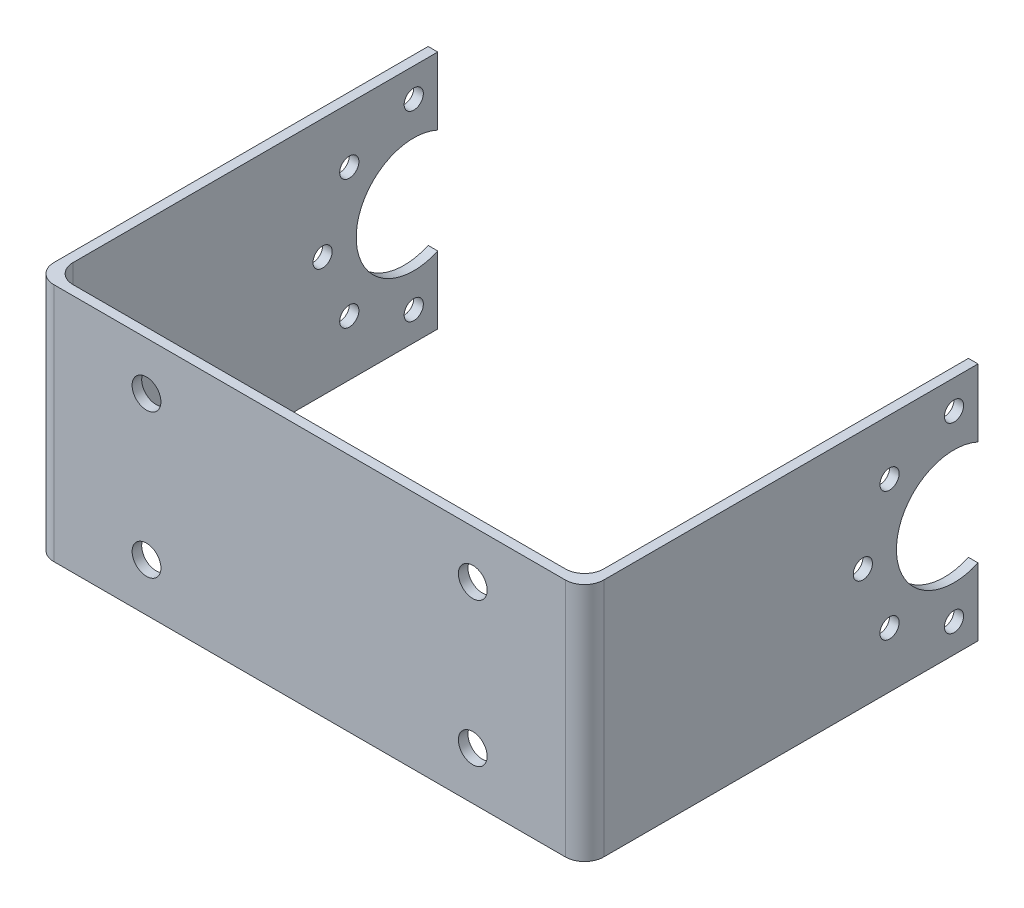
ISO-10303-21;
HEADER;
FILE_DESCRIPTION(('STEP AP214'),'2;1');
FILE_NAME('part.step','',(''),(''),'','','');
FILE_SCHEMA(('AUTOMOTIVE_DESIGN { 1 0 10303 214 1 1 1 1 }'));
ENDSEC;
DATA;
#1=APPLICATION_CONTEXT('core data for automotive mechanical design processes');
#2=APPLICATION_PROTOCOL_DEFINITION('international standard','automotive_design',2000,#1);
#3=PRODUCT_CONTEXT('',#1,'mechanical');
#4=PRODUCT('Part','Part','',(#3));
#5=PRODUCT_RELATED_PRODUCT_CATEGORY('part','',(#4));
#6=PRODUCT_DEFINITION_FORMATION('','',#4);
#7=PRODUCT_DEFINITION_CONTEXT('part definition',#1,'design');
#8=PRODUCT_DEFINITION('design','',#6,#7);
#9=PRODUCT_DEFINITION_SHAPE('','',#8);
#10=(LENGTH_UNIT() NAMED_UNIT(*) SI_UNIT(.MILLI.,.METRE.));
#11=(NAMED_UNIT(*) PLANE_ANGLE_UNIT() SI_UNIT($,.RADIAN.));
#12=(NAMED_UNIT(*) SI_UNIT($,.STERADIAN.) SOLID_ANGLE_UNIT());
#13=UNCERTAINTY_MEASURE_WITH_UNIT(LENGTH_MEASURE(1.E-05),#10,'distance_accuracy_value','');
#14=(GEOMETRIC_REPRESENTATION_CONTEXT(3) GLOBAL_UNCERTAINTY_ASSIGNED_CONTEXT((#13)) GLOBAL_UNIT_ASSIGNED_CONTEXT((#10,
#11,#12)) REPRESENTATION_CONTEXT('',''));
#15=CARTESIAN_POINT('',(0.,0.,0.));
#16=DIRECTION('',(0.,0.,1.));
#17=DIRECTION('',(1.,0.,0.));
#18=AXIS2_PLACEMENT_3D('',#15,#16,#17);
#19=CARTESIAN_POINT('',(34.8000000000001,25.,-40.5));
#20=DIRECTION('',(0.,0.,1.));
#21=DIRECTION('',(1.,0.,0.));
#22=AXIS2_PLACEMENT_3D('',#19,#20,#21);
#23=PLANE('',#22);
#24=DIRECTION('',(0.,-1.,0.));
#25=VECTOR('',#24,1.);
#26=CARTESIAN_POINT('',(33.8000000000001,25.,-40.5));
#27=LINE('',#26,#25);
#28=CARTESIAN_POINT('',(33.8000000000001,7.04564394268215,-40.5));
#29=VERTEX_POINT('',#28);
#30=CARTESIAN_POINT('',(33.8000000000001,0.,-40.5));
#31=VERTEX_POINT('',#30);
#32=EDGE_CURVE('E216',#29,#31,#27,.T.);
#33=ORIENTED_EDGE('',*,*,#32,.F.);
#34=DIRECTION('',(1.,0.,0.));
#35=VECTOR('',#34,1.);
#36=CARTESIAN_POINT('',(-22.4999999999999,7.04564394268215,-40.5));
#37=LINE('',#36,#35);
#38=CARTESIAN_POINT('',(34.8000000000001,7.04564394268215,-40.5));
#39=VERTEX_POINT('',#38);
#40=EDGE_CURVE('E200',#29,#39,#37,.T.);
#41=ORIENTED_EDGE('',*,*,#40,.T.);
#42=DIRECTION('',(0.,-1.,0.));
#43=VECTOR('',#42,1.);
#44=CARTESIAN_POINT('',(34.8000000000001,25.,-40.5));
#45=LINE('',#44,#43);
#46=CARTESIAN_POINT('',(34.8000000000001,0.,-40.5));
#47=VERTEX_POINT('',#46);
#48=EDGE_CURVE('E220',#39,#47,#45,.T.);
#49=ORIENTED_EDGE('',*,*,#48,.T.);
#50=DIRECTION('',(-1.,0.,0.));
#51=VECTOR('',#50,1.);
#52=CARTESIAN_POINT('',(34.8000000000001,0.,-40.5));
#53=LINE('',#52,#51);
#54=EDGE_CURVE('E272',#47,#31,#53,.T.);
#55=ORIENTED_EDGE('',*,*,#54,.T.);
#56=EDGE_LOOP('',(#33,#41,#49,#55));
#57=FACE_BOUND('',#56,.T.);
#58=ADVANCED_FACE('F65',(#57),#23,.F.);
#59=CARTESIAN_POINT('',(-22.4999999999999,25.,-40.5));
#60=DIRECTION('',(0.,0.,1.));
#61=DIRECTION('',(1.,0.,0.));
#62=AXIS2_PLACEMENT_3D('',#59,#60,#61);
#63=PLANE('',#62);
#64=DIRECTION('',(0.,-1.,0.));
#65=VECTOR('',#64,1.);
#66=CARTESIAN_POINT('',(-22.4999999999999,25.,-40.5));
#67=LINE('',#66,#65);
#68=CARTESIAN_POINT('',(-22.4999999999999,7.04564394268215,-40.5));
#69=VERTEX_POINT('',#68);
#70=CARTESIAN_POINT('',(-22.4999999999999,0.,-40.5));
#71=VERTEX_POINT('',#70);
#72=EDGE_CURVE('E207',#69,#71,#67,.T.);
#73=ORIENTED_EDGE('',*,*,#72,.F.);
#74=CARTESIAN_POINT('',(-21.4999999999999,7.04564394268215,-40.5));
#75=VERTEX_POINT('',#74);
#76=EDGE_CURVE('E184',#69,#75,#37,.T.);
#77=ORIENTED_EDGE('',*,*,#76,.T.);
#78=DIRECTION('',(0.,-1.,0.));
#79=VECTOR('',#78,1.);
#80=CARTESIAN_POINT('',(-21.4999999999999,25.,-40.5));
#81=LINE('',#80,#79);
#82=CARTESIAN_POINT('',(-21.4999999999999,0.,-40.5));
#83=VERTEX_POINT('',#82);
#84=EDGE_CURVE('E206',#75,#83,#81,.T.);
#85=ORIENTED_EDGE('',*,*,#84,.T.);
#86=DIRECTION('',(-1.,0.,0.));
#87=VECTOR('',#86,1.);
#88=CARTESIAN_POINT('',(-22.4999999999999,0.,-40.5));
#89=LINE('',#88,#87);
#90=EDGE_CURVE('E298',#83,#71,#89,.T.);
#91=ORIENTED_EDGE('',*,*,#90,.T.);
#92=EDGE_LOOP('',(#73,#77,#85,#91));
#93=FACE_BOUND('',#92,.T.);
#94=ADVANCED_FACE('F450',(#93),#63,.F.);
#95=CARTESIAN_POINT('',(34.8000000000001,25.,-0.500000000000003));
#96=DIRECTION('',(-1.,0.,0.));
#97=DIRECTION('',(0.,0.,1.));
#98=AXIS2_PLACEMENT_3D('',#95,#96,#97);
#99=PLANE('',#98);
#100=CARTESIAN_POINT('',(34.8000000000001,5.7824855787278,-31.2824855787278));
#101=DIRECTION('',(1.,0.,0.));
#102=DIRECTION('',(0.,0.,-1.));
#103=AXIS2_PLACEMENT_3D('',#100,#101,#102);
#104=CIRCLE('',#103,0.999999999999998);
#105=CARTESIAN_POINT('',(34.8000000000001,5.7824855787278,-32.2824855787278));
#106=VERTEX_POINT('',#105);
#107=EDGE_CURVE('E370',#106,#106,#104,.T.);
#108=ORIENTED_EDGE('',*,*,#107,.F.);
#109=EDGE_LOOP('',(#108));
#110=FACE_BOUND('',#109,.T.);
#111=CARTESIAN_POINT('',(34.8000000000001,3.,-38.));
#112=DIRECTION('',(1.,0.,0.));
#113=DIRECTION('',(0.,0.,-1.));
#114=AXIS2_PLACEMENT_3D('',#111,#112,#113);
#115=CIRCLE('',#114,0.999999999999998);
#116=CARTESIAN_POINT('',(34.8000000000001,3.,-39.));
#117=VERTEX_POINT('',#116);
#118=EDGE_CURVE('E358',#117,#117,#115,.T.);
#119=ORIENTED_EDGE('',*,*,#118,.F.);
#120=EDGE_LOOP('',(#119));
#121=FACE_BOUND('',#120,.T.);
#122=CARTESIAN_POINT('',(34.8000000000001,12.5,-28.5));
#123=DIRECTION('',(1.,0.,0.));
#124=DIRECTION('',(0.,0.,-1.));
#125=AXIS2_PLACEMENT_3D('',#122,#123,#124);
#126=CIRCLE('',#125,1.);
#127=CARTESIAN_POINT('',(34.8000000000001,12.5,-29.5));
#128=VERTEX_POINT('',#127);
#129=EDGE_CURVE('E346',#128,#128,#126,.T.);
#130=ORIENTED_EDGE('',*,*,#129,.F.);
#131=EDGE_LOOP('',(#130));
#132=FACE_BOUND('',#131,.T.);
#133=CARTESIAN_POINT('',(34.8000000000001,19.2175144212722,-31.2824855787278));
#134=DIRECTION('',(1.,0.,0.));
#135=DIRECTION('',(0.,0.,-1.));
#136=AXIS2_PLACEMENT_3D('',#133,#134,#135);
#137=CIRCLE('',#136,1.00000000000001);
#138=CARTESIAN_POINT('',(34.8000000000001,19.2175144212722,-32.2824855787278));
#139=VERTEX_POINT('',#138);
#140=EDGE_CURVE('E334',#139,#139,#137,.T.);
#141=ORIENTED_EDGE('',*,*,#140,.F.);
#142=EDGE_LOOP('',(#141));
#143=FACE_BOUND('',#142,.T.);
#144=CARTESIAN_POINT('',(34.8000000000001,22.,-38.));
#145=DIRECTION('',(1.,0.,0.));
#146=DIRECTION('',(0.,0.,-1.));
#147=AXIS2_PLACEMENT_3D('',#144,#145,#146);
#148=CIRCLE('',#147,0.999999999999998);
#149=CARTESIAN_POINT('',(34.8000000000001,22.,-39.));
#150=VERTEX_POINT('',#149);
#151=EDGE_CURVE('E322',#150,#150,#148,.T.);
#152=ORIENTED_EDGE('',*,*,#151,.F.);
#153=EDGE_LOOP('',(#152));
#154=FACE_BOUND('',#153,.T.);
#155=DIRECTION('',(0.,0.,-1.));
#156=VECTOR('',#155,1.);
#157=CARTESIAN_POINT('',(34.8000000000001,25.,-0.500000000000003));
#158=LINE('',#157,#156);
#159=CARTESIAN_POINT('',(34.8000000000001,25.,-1.5));
#160=VERTEX_POINT('',#159);
#161=CARTESIAN_POINT('',(34.8000000000001,25.,-40.5));
#162=VERTEX_POINT('',#161);
#163=EDGE_CURVE('E304',#160,#162,#158,.T.);
#164=ORIENTED_EDGE('',*,*,#163,.F.);
#165=DIRECTION('',(0.,-1.,0.));
#166=VECTOR('',#165,1.);
#167=CARTESIAN_POINT('',(34.8000000000001,25.,-1.5));
#168=LINE('',#167,#166);
#169=CARTESIAN_POINT('',(34.8000000000001,0.,-1.5));
#170=VERTEX_POINT('',#169);
#171=EDGE_CURVE('E246',#160,#170,#168,.T.);
#172=ORIENTED_EDGE('',*,*,#171,.T.);
#173=DIRECTION('',(0.,0.,-1.));
#174=VECTOR('',#173,1.);
#175=CARTESIAN_POINT('',(34.8000000000001,0.,-0.500000000000003));
#176=LINE('',#175,#174);
#177=EDGE_CURVE('E291',#170,#47,#176,.T.);
#178=ORIENTED_EDGE('',*,*,#177,.T.);
#179=ORIENTED_EDGE('',*,*,#48,.F.);
#180=CARTESIAN_POINT('',(34.8000000000001,12.5,-38.));
#181=DIRECTION('',(1.,0.,0.));
#182=DIRECTION('',(0.,0.,-1.));
#183=AXIS2_PLACEMENT_3D('',#180,#181,#182);
#184=CIRCLE('',#183,5.99999999999999);
#185=CARTESIAN_POINT('',(34.8000000000001,17.9543560573178,-40.5));
#186=VERTEX_POINT('',#185);
#187=EDGE_CURVE('E189',#186,#39,#184,.T.);
#188=ORIENTED_EDGE('',*,*,#187,.F.);
#189=EDGE_CURVE('E221',#162,#186,#45,.T.);
#190=ORIENTED_EDGE('',*,*,#189,.F.);
#191=EDGE_LOOP('',(#164,#172,#178,#179,#188,#190));
#192=FACE_BOUND('',#191,.T.);
#193=ADVANCED_FACE('F425',(#110,#121,#132,#143,#154,#192),#99,.F.);
#194=ORIENTED_EDGE('',*,*,#189,.T.);
#195=DIRECTION('',(1.,0.,0.));
#196=VECTOR('',#195,1.);
#197=CARTESIAN_POINT('',(-22.4999999999999,17.9543560573178,-40.5));
#198=LINE('',#197,#196);
#199=CARTESIAN_POINT('',(33.8000000000001,17.9543560573178,-40.5));
#200=VERTEX_POINT('',#199);
#201=EDGE_CURVE('E188',#200,#186,#198,.T.);
#202=ORIENTED_EDGE('',*,*,#201,.F.);
#203=CARTESIAN_POINT('',(33.8000000000001,25.,-40.5));
#204=VERTEX_POINT('',#203);
#205=EDGE_CURVE('E217',#204,#200,#27,.T.);
#206=ORIENTED_EDGE('',*,*,#205,.F.);
#207=DIRECTION('',(-1.,0.,0.));
#208=VECTOR('',#207,1.);
#209=CARTESIAN_POINT('',(34.8000000000001,25.,-40.5));
#210=LINE('',#209,#208);
#211=EDGE_CURVE('E283',#162,#204,#210,.T.);
#212=ORIENTED_EDGE('',*,*,#211,.F.);
#213=EDGE_LOOP('',(#194,#202,#206,#212));
#214=FACE_BOUND('',#213,.T.);
#215=ADVANCED_FACE('F433',(#214),#23,.F.);
#216=CARTESIAN_POINT('',(33.8000000000001,25.,-0.499999999999996));
#217=DIRECTION('',(1.,0.,0.));
#218=DIRECTION('',(0.,0.,-1.));
#219=AXIS2_PLACEMENT_3D('',#216,#217,#218);
#220=PLANE('',#219);
#221=CARTESIAN_POINT('',(33.8000000000001,5.7824855787278,-31.2824855787278));
#222=DIRECTION('',(1.,0.,0.));
#223=DIRECTION('',(0.,0.,-1.));
#224=AXIS2_PLACEMENT_3D('',#221,#222,#223);
#225=CIRCLE('',#224,0.999999999999998);
#226=CARTESIAN_POINT('',(33.8000000000001,5.7824855787278,-32.2824855787278));
#227=VERTEX_POINT('',#226);
#228=EDGE_CURVE('E362',#227,#227,#225,.T.);
#229=ORIENTED_EDGE('',*,*,#228,.T.);
#230=EDGE_LOOP('',(#229));
#231=FACE_BOUND('',#230,.T.);
#232=CARTESIAN_POINT('',(33.8000000000001,3.,-38.));
#233=DIRECTION('',(1.,0.,0.));
#234=DIRECTION('',(0.,0.,-1.));
#235=AXIS2_PLACEMENT_3D('',#232,#233,#234);
#236=CIRCLE('',#235,0.999999999999998);
#237=CARTESIAN_POINT('',(33.8000000000001,3.,-39.));
#238=VERTEX_POINT('',#237);
#239=EDGE_CURVE('E350',#238,#238,#236,.T.);
#240=ORIENTED_EDGE('',*,*,#239,.T.);
#241=EDGE_LOOP('',(#240));
#242=FACE_BOUND('',#241,.T.);
#243=CARTESIAN_POINT('',(33.8000000000001,12.5,-28.5));
#244=DIRECTION('',(1.,0.,0.));
#245=DIRECTION('',(0.,0.,-1.));
#246=AXIS2_PLACEMENT_3D('',#243,#244,#245);
#247=CIRCLE('',#246,1.);
#248=CARTESIAN_POINT('',(33.8000000000001,12.5,-29.5));
#249=VERTEX_POINT('',#248);
#250=EDGE_CURVE('E338',#249,#249,#247,.T.);
#251=ORIENTED_EDGE('',*,*,#250,.T.);
#252=EDGE_LOOP('',(#251));
#253=FACE_BOUND('',#252,.T.);
#254=CARTESIAN_POINT('',(33.8000000000001,19.2175144212722,-31.2824855787278));
#255=DIRECTION('',(1.,0.,0.));
#256=DIRECTION('',(0.,0.,-1.));
#257=AXIS2_PLACEMENT_3D('',#254,#255,#256);
#258=CIRCLE('',#257,1.00000000000001);
#259=CARTESIAN_POINT('',(33.8000000000001,19.2175144212722,-32.2824855787278));
#260=VERTEX_POINT('',#259);
#261=EDGE_CURVE('E326',#260,#260,#258,.T.);
#262=ORIENTED_EDGE('',*,*,#261,.T.);
#263=EDGE_LOOP('',(#262));
#264=FACE_BOUND('',#263,.T.);
#265=CARTESIAN_POINT('',(33.8000000000001,22.,-38.));
#266=DIRECTION('',(1.,0.,0.));
#267=DIRECTION('',(0.,0.,-1.));
#268=AXIS2_PLACEMENT_3D('',#265,#266,#267);
#269=CIRCLE('',#268,0.999999999999998);
#270=CARTESIAN_POINT('',(33.8000000000001,22.,-39.));
#271=VERTEX_POINT('',#270);
#272=EDGE_CURVE('E315',#271,#271,#269,.T.);
#273=ORIENTED_EDGE('',*,*,#272,.T.);
#274=EDGE_LOOP('',(#273));
#275=FACE_BOUND('',#274,.T.);
#276=DIRECTION('',(0.,0.,1.));
#277=VECTOR('',#276,1.);
#278=CARTESIAN_POINT('',(33.8000000000001,0.,-0.499999999999996));
#279=LINE('',#278,#277);
#280=CARTESIAN_POINT('',(33.8000000000001,0.,-2.5));
#281=VERTEX_POINT('',#280);
#282=EDGE_CURVE('E260',#31,#281,#279,.T.);
#283=ORIENTED_EDGE('',*,*,#282,.T.);
#284=DIRECTION('',(0.,-1.,0.));
#285=VECTOR('',#284,1.);
#286=CARTESIAN_POINT('',(33.8000000000001,25.,-2.5));
#287=LINE('',#286,#285);
#288=CARTESIAN_POINT('',(33.8000000000001,25.,-2.5));
#289=VERTEX_POINT('',#288);
#290=EDGE_CURVE('E249',#281,#289,#287,.F.);
#291=ORIENTED_EDGE('',*,*,#290,.T.);
#292=DIRECTION('',(0.,0.,1.));
#293=VECTOR('',#292,1.);
#294=CARTESIAN_POINT('',(33.8000000000001,25.,-0.499999999999996));
#295=LINE('',#294,#293);
#296=EDGE_CURVE('E277',#204,#289,#295,.T.);
#297=ORIENTED_EDGE('',*,*,#296,.F.);
#298=ORIENTED_EDGE('',*,*,#205,.T.);
#299=CARTESIAN_POINT('',(33.8000000000001,12.5,-38.));
#300=DIRECTION('',(1.,0.,0.));
#301=DIRECTION('',(0.,0.,-1.));
#302=AXIS2_PLACEMENT_3D('',#299,#300,#301);
#303=CIRCLE('',#302,5.99999999999999);
#304=EDGE_CURVE('E293',#200,#29,#303,.T.);
#305=ORIENTED_EDGE('',*,*,#304,.T.);
#306=ORIENTED_EDGE('',*,*,#32,.T.);
#307=EDGE_LOOP('',(#283,#291,#297,#298,#305,#306));
#308=FACE_BOUND('',#307,.T.);
#309=ADVANCED_FACE('F266',(#231,#242,#253,#264,#275,#308),#220,.F.);
#310=CARTESIAN_POINT('',(-21.4999999999999,25.,-0.499999999999996));
#311=DIRECTION('',(0.,0.,1.));
#312=DIRECTION('',(1.,0.,0.));
#313=AXIS2_PLACEMENT_3D('',#310,#311,#312);
#314=PLANE('',#313);
#315=CARTESIAN_POINT('',(23.1500000000001,5.,-0.499999999999994));
#316=DIRECTION('',(0.,0.,1.));
#317=DIRECTION('',(1.,0.,0.));
#318=AXIS2_PLACEMENT_3D('',#315,#316,#317);
#319=CIRCLE('',#318,1.5);
#320=CARTESIAN_POINT('',(24.6500000000001,5.,-0.499999999999994));
#321=VERTEX_POINT('',#320);
#322=EDGE_CURVE('E394',#321,#321,#319,.T.);
#323=ORIENTED_EDGE('',*,*,#322,.T.);
#324=EDGE_LOOP('',(#323));
#325=FACE_BOUND('',#324,.T.);
#326=CARTESIAN_POINT('',(23.1500000000001,20.,-0.499999999999994));
#327=DIRECTION('',(0.,0.,1.));
#328=DIRECTION('',(1.,0.,0.));
#329=AXIS2_PLACEMENT_3D('',#326,#327,#328);
#330=CIRCLE('',#329,1.5);
#331=CARTESIAN_POINT('',(24.6500000000001,20.,-0.499999999999994));
#332=VERTEX_POINT('',#331);
#333=EDGE_CURVE('E388',#332,#332,#330,.T.);
#334=ORIENTED_EDGE('',*,*,#333,.T.);
#335=EDGE_LOOP('',(#334));
#336=FACE_BOUND('',#335,.T.);
#337=CARTESIAN_POINT('',(-10.8499999999999,5.,-0.499999999999994));
#338=DIRECTION('',(0.,0.,1.));
#339=DIRECTION('',(1.,0.,0.));
#340=AXIS2_PLACEMENT_3D('',#337,#338,#339);
#341=CIRCLE('',#340,1.5);
#342=CARTESIAN_POINT('',(-9.34999999999994,5.,-0.499999999999994));
#343=VERTEX_POINT('',#342);
#344=EDGE_CURVE('E382',#343,#343,#341,.T.);
#345=ORIENTED_EDGE('',*,*,#344,.T.);
#346=EDGE_LOOP('',(#345));
#347=FACE_BOUND('',#346,.T.);
#348=CARTESIAN_POINT('',(-10.8499999999999,20.,-0.499999999999994));
#349=DIRECTION('',(0.,0.,1.));
#350=DIRECTION('',(1.,0.,0.));
#351=AXIS2_PLACEMENT_3D('',#348,#349,#350);
#352=CIRCLE('',#351,1.5);
#353=CARTESIAN_POINT('',(-9.34999999999994,20.,-0.499999999999994));
#354=VERTEX_POINT('',#353);
#355=EDGE_CURVE('E374',#354,#354,#352,.T.);
#356=ORIENTED_EDGE('',*,*,#355,.T.);
#357=EDGE_LOOP('',(#356));
#358=FACE_BOUND('',#357,.T.);
#359=DIRECTION('',(-1.,0.,0.));
#360=VECTOR('',#359,1.);
#361=CARTESIAN_POINT('',(-21.4999999999999,0.,-0.499999999999996));
#362=LINE('',#361,#360);
#363=CARTESIAN_POINT('',(31.8000000000001,0.,-0.499999999999996));
#364=VERTEX_POINT('',#363);
#365=CARTESIAN_POINT('',(-19.4999999999999,0.,-0.499999999999996));
#366=VERTEX_POINT('',#365);
#367=EDGE_CURVE('E261',#364,#366,#362,.T.);
#368=ORIENTED_EDGE('',*,*,#367,.T.);
#369=DIRECTION('',(0.,-1.,0.));
#370=VECTOR('',#369,1.);
#371=CARTESIAN_POINT('',(-19.4999999999999,25.,-0.499999999999996));
#372=LINE('',#371,#370);
#373=CARTESIAN_POINT('',(-19.4999999999999,25.,-0.499999999999996));
#374=VERTEX_POINT('',#373);
#375=EDGE_CURVE('E88',#366,#374,#372,.F.);
#376=ORIENTED_EDGE('',*,*,#375,.T.);
#377=DIRECTION('',(-1.,0.,0.));
#378=VECTOR('',#377,1.);
#379=CARTESIAN_POINT('',(-21.4999999999999,25.,-0.499999999999996));
#380=LINE('',#379,#378);
#381=CARTESIAN_POINT('',(31.8000000000001,25.,-0.499999999999996));
#382=VERTEX_POINT('',#381);
#383=EDGE_CURVE('E276',#382,#374,#380,.T.);
#384=ORIENTED_EDGE('',*,*,#383,.F.);
#385=DIRECTION('',(0.,-1.,0.));
#386=VECTOR('',#385,1.);
#387=CARTESIAN_POINT('',(31.8000000000001,0.,-0.499999999999996));
#388=LINE('',#387,#386);
#389=EDGE_CURVE('E242',#382,#364,#388,.T.);
#390=ORIENTED_EDGE('',*,*,#389,.T.);
#391=EDGE_LOOP('',(#368,#376,#384,#390));
#392=FACE_BOUND('',#391,.T.);
#393=ADVANCED_FACE('F278',(#325,#336,#347,#358,#392),#314,.F.);
#394=CARTESIAN_POINT('',(-21.4999999999999,25.,-0.499999999999996));
#395=DIRECTION('',(-1.,0.,0.));
#396=DIRECTION('',(0.,0.,1.));
#397=AXIS2_PLACEMENT_3D('',#394,#395,#396);
#398=PLANE('',#397);
#399=CARTESIAN_POINT('',(-21.4999999999999,5.7824855787278,-31.2824855787278));
#400=DIRECTION('',(-1.,0.,0.));
#401=DIRECTION('',(0.,0.,1.));
#402=AXIS2_PLACEMENT_3D('',#399,#400,#401);
#403=CIRCLE('',#402,0.999999999999998);
#404=CARTESIAN_POINT('',(-21.4999999999999,5.7824855787278,-30.2824855787278));
#405=VERTEX_POINT('',#404);
#406=EDGE_CURVE('E367',#405,#405,#403,.T.);
#407=ORIENTED_EDGE('',*,*,#406,.T.);
#408=EDGE_LOOP('',(#407));
#409=FACE_BOUND('',#408,.T.);
#410=CARTESIAN_POINT('',(-21.4999999999999,3.,-38.));
#411=DIRECTION('',(-1.,0.,0.));
#412=DIRECTION('',(0.,0.,1.));
#413=AXIS2_PLACEMENT_3D('',#410,#411,#412);
#414=CIRCLE('',#413,0.999999999999998);
#415=CARTESIAN_POINT('',(-21.4999999999999,3.,-37.));
#416=VERTEX_POINT('',#415);
#417=EDGE_CURVE('E355',#416,#416,#414,.T.);
#418=ORIENTED_EDGE('',*,*,#417,.T.);
#419=EDGE_LOOP('',(#418));
#420=FACE_BOUND('',#419,.T.);
#421=CARTESIAN_POINT('',(-21.4999999999999,12.5,-28.5));
#422=DIRECTION('',(-1.,0.,0.));
#423=DIRECTION('',(0.,0.,1.));
#424=AXIS2_PLACEMENT_3D('',#421,#422,#423);
#425=CIRCLE('',#424,1.);
#426=CARTESIAN_POINT('',(-21.4999999999999,12.5,-27.5));
#427=VERTEX_POINT('',#426);
#428=EDGE_CURVE('E343',#427,#427,#425,.T.);
#429=ORIENTED_EDGE('',*,*,#428,.T.);
#430=EDGE_LOOP('',(#429));
#431=FACE_BOUND('',#430,.T.);
#432=CARTESIAN_POINT('',(-21.4999999999999,19.2175144212722,-31.2824855787278));
#433=DIRECTION('',(-1.,0.,0.));
#434=DIRECTION('',(0.,0.,1.));
#435=AXIS2_PLACEMENT_3D('',#432,#433,#434);
#436=CIRCLE('',#435,1.00000000000001);
#437=CARTESIAN_POINT('',(-21.4999999999999,19.2175144212722,-30.2824855787278));
#438=VERTEX_POINT('',#437);
#439=EDGE_CURVE('E331',#438,#438,#436,.T.);
#440=ORIENTED_EDGE('',*,*,#439,.T.);
#441=EDGE_LOOP('',(#440));
#442=FACE_BOUND('',#441,.T.);
#443=CARTESIAN_POINT('',(-21.4999999999999,22.,-38.));
#444=DIRECTION('',(-1.,0.,0.));
#445=DIRECTION('',(0.,0.,1.));
#446=AXIS2_PLACEMENT_3D('',#443,#444,#445);
#447=CIRCLE('',#446,0.999999999999998);
#448=CARTESIAN_POINT('',(-21.4999999999999,22.,-37.));
#449=VERTEX_POINT('',#448);
#450=EDGE_CURVE('E319',#449,#449,#447,.T.);
#451=ORIENTED_EDGE('',*,*,#450,.T.);
#452=EDGE_LOOP('',(#451));
#453=FACE_BOUND('',#452,.T.);
#454=DIRECTION('',(0.,0.,-1.));
#455=VECTOR('',#454,1.);
#456=CARTESIAN_POINT('',(-21.4999999999999,25.,-0.499999999999996));
#457=LINE('',#456,#455);
#458=CARTESIAN_POINT('',(-21.4999999999999,25.,-2.5));
#459=VERTEX_POINT('',#458);
#460=CARTESIAN_POINT('',(-21.4999999999999,25.,-40.5));
#461=VERTEX_POINT('',#460);
#462=EDGE_CURVE('E279',#459,#461,#457,.T.);
#463=ORIENTED_EDGE('',*,*,#462,.F.);
#464=DIRECTION('',(0.,-1.,0.));
#465=VECTOR('',#464,1.);
#466=CARTESIAN_POINT('',(-21.4999999999999,0.,-2.5));
#467=LINE('',#466,#465);
#468=CARTESIAN_POINT('',(-21.4999999999999,0.,-2.5));
#469=VERTEX_POINT('',#468);
#470=EDGE_CURVE('E239',#459,#469,#467,.T.);
#471=ORIENTED_EDGE('',*,*,#470,.T.);
#472=DIRECTION('',(0.,0.,-1.));
#473=VECTOR('',#472,1.);
#474=CARTESIAN_POINT('',(-21.4999999999999,0.,-0.499999999999996));
#475=LINE('',#474,#473);
#476=EDGE_CURVE('E296',#469,#83,#475,.T.);
#477=ORIENTED_EDGE('',*,*,#476,.T.);
#478=ORIENTED_EDGE('',*,*,#84,.F.);
#479=CARTESIAN_POINT('',(-21.4999999999999,12.5,-38.));
#480=DIRECTION('',(-1.,0.,0.));
#481=DIRECTION('',(0.,0.,1.));
#482=AXIS2_PLACEMENT_3D('',#479,#480,#481);
#483=CIRCLE('',#482,5.99999999999999);
#484=CARTESIAN_POINT('',(-21.4999999999999,17.9543560573178,-40.5));
#485=VERTEX_POINT('',#484);
#486=EDGE_CURVE('E312',#75,#485,#483,.T.);
#487=ORIENTED_EDGE('',*,*,#486,.T.);
#488=EDGE_CURVE('E199',#461,#485,#81,.T.);
#489=ORIENTED_EDGE('',*,*,#488,.F.);
#490=EDGE_LOOP('',(#463,#471,#477,#478,#487,#489));
#491=FACE_BOUND('',#490,.T.);
#492=ADVANCED_FACE('F532',(#409,#420,#431,#442,#453,#491),#398,.F.);
#493=ORIENTED_EDGE('',*,*,#488,.T.);
#494=CARTESIAN_POINT('',(-22.4999999999999,17.9543560573178,-40.5));
#495=VERTEX_POINT('',#494);
#496=EDGE_CURVE('E181',#495,#485,#198,.T.);
#497=ORIENTED_EDGE('',*,*,#496,.F.);
#498=CARTESIAN_POINT('',(-22.4999999999999,25.,-40.5));
#499=VERTEX_POINT('',#498);
#500=EDGE_CURVE('E196',#499,#495,#67,.T.);
#501=ORIENTED_EDGE('',*,*,#500,.F.);
#502=DIRECTION('',(-1.,0.,0.));
#503=VECTOR('',#502,1.);
#504=CARTESIAN_POINT('',(-22.4999999999999,25.,-40.5));
#505=LINE('',#504,#503);
#506=EDGE_CURVE('E281',#461,#499,#505,.T.);
#507=ORIENTED_EDGE('',*,*,#506,.F.);
#508=EDGE_LOOP('',(#493,#497,#501,#507));
#509=FACE_BOUND('',#508,.T.);
#510=ADVANCED_FACE('F194',(#509),#63,.F.);
#511=CARTESIAN_POINT('',(-22.4999999999999,25.,-0.499999999999996));
#512=DIRECTION('',(1.,0.,0.));
#513=DIRECTION('',(0.,0.,-1.));
#514=AXIS2_PLACEMENT_3D('',#511,#512,#513);
#515=PLANE('',#514);
#516=CARTESIAN_POINT('',(-22.4999999999999,5.7824855787278,-31.2824855787278));
#517=DIRECTION('',(1.,0.,0.));
#518=DIRECTION('',(0.,0.,-1.));
#519=AXIS2_PLACEMENT_3D('',#516,#517,#518);
#520=CIRCLE('',#519,0.999999999999998);
#521=CARTESIAN_POINT('',(-22.4999999999999,5.7824855787278,-32.2824855787278));
#522=VERTEX_POINT('',#521);
#523=EDGE_CURVE('E371',#522,#522,#520,.T.);
#524=ORIENTED_EDGE('',*,*,#523,.T.);
#525=EDGE_LOOP('',(#524));
#526=FACE_BOUND('',#525,.T.);
#527=CARTESIAN_POINT('',(-22.4999999999999,3.,-38.));
#528=DIRECTION('',(1.,0.,0.));
#529=DIRECTION('',(0.,0.,-1.));
#530=AXIS2_PLACEMENT_3D('',#527,#528,#529);
#531=CIRCLE('',#530,0.999999999999998);
#532=CARTESIAN_POINT('',(-22.4999999999999,3.,-39.));
#533=VERTEX_POINT('',#532);
#534=EDGE_CURVE('E359',#533,#533,#531,.T.);
#535=ORIENTED_EDGE('',*,*,#534,.T.);
#536=EDGE_LOOP('',(#535));
#537=FACE_BOUND('',#536,.T.);
#538=CARTESIAN_POINT('',(-22.4999999999999,12.5,-28.5));
#539=DIRECTION('',(1.,0.,0.));
#540=DIRECTION('',(0.,0.,-1.));
#541=AXIS2_PLACEMENT_3D('',#538,#539,#540);
#542=CIRCLE('',#541,1.);
#543=CARTESIAN_POINT('',(-22.4999999999999,12.5,-29.5));
#544=VERTEX_POINT('',#543);
#545=EDGE_CURVE('E347',#544,#544,#542,.T.);
#546=ORIENTED_EDGE('',*,*,#545,.T.);
#547=EDGE_LOOP('',(#546));
#548=FACE_BOUND('',#547,.T.);
#549=CARTESIAN_POINT('',(-22.4999999999999,19.2175144212722,-31.2824855787278));
#550=DIRECTION('',(1.,0.,0.));
#551=DIRECTION('',(0.,0.,-1.));
#552=AXIS2_PLACEMENT_3D('',#549,#550,#551);
#553=CIRCLE('',#552,1.00000000000001);
#554=CARTESIAN_POINT('',(-22.4999999999999,19.2175144212722,-32.2824855787278));
#555=VERTEX_POINT('',#554);
#556=EDGE_CURVE('E335',#555,#555,#553,.T.);
#557=ORIENTED_EDGE('',*,*,#556,.T.);
#558=EDGE_LOOP('',(#557));
#559=FACE_BOUND('',#558,.T.);
#560=CARTESIAN_POINT('',(-22.4999999999999,22.,-38.));
#561=DIRECTION('',(1.,0.,0.));
#562=DIRECTION('',(0.,0.,-1.));
#563=AXIS2_PLACEMENT_3D('',#560,#561,#562);
#564=CIRCLE('',#563,0.999999999999998);
#565=CARTESIAN_POINT('',(-22.4999999999999,22.,-39.));
#566=VERTEX_POINT('',#565);
#567=EDGE_CURVE('E323',#566,#566,#564,.T.);
#568=ORIENTED_EDGE('',*,*,#567,.T.);
#569=EDGE_LOOP('',(#568));
#570=FACE_BOUND('',#569,.T.);
#571=DIRECTION('',(0.,0.,1.));
#572=VECTOR('',#571,1.);
#573=CARTESIAN_POINT('',(-22.4999999999999,0.,-0.499999999999996));
#574=LINE('',#573,#572);
#575=CARTESIAN_POINT('',(-22.4999999999999,0.,-1.5));
#576=VERTEX_POINT('',#575);
#577=EDGE_CURVE('E300',#71,#576,#574,.T.);
#578=ORIENTED_EDGE('',*,*,#577,.T.);
#579=DIRECTION('',(0.,-1.,0.));
#580=VECTOR('',#579,1.);
#581=CARTESIAN_POINT('',(-22.4999999999999,25.,-1.5));
#582=LINE('',#581,#580);
#583=CARTESIAN_POINT('',(-22.4999999999999,25.,-1.5));
#584=VERTEX_POINT('',#583);
#585=EDGE_CURVE('E233',#576,#584,#582,.F.);
#586=ORIENTED_EDGE('',*,*,#585,.T.);
#587=DIRECTION('',(0.,0.,1.));
#588=VECTOR('',#587,1.);
#589=CARTESIAN_POINT('',(-22.4999999999999,25.,-0.499999999999996));
#590=LINE('',#589,#588);
#591=EDGE_CURVE('E205',#499,#584,#590,.T.);
#592=ORIENTED_EDGE('',*,*,#591,.F.);
#593=ORIENTED_EDGE('',*,*,#500,.T.);
#594=CARTESIAN_POINT('',(-22.4999999999999,12.5,-38.));
#595=DIRECTION('',(1.,0.,0.));
#596=DIRECTION('',(0.,0.,-1.));
#597=AXIS2_PLACEMENT_3D('',#594,#595,#596);
#598=CIRCLE('',#597,5.99999999999999);
#599=EDGE_CURVE('E178',#495,#69,#598,.T.);
#600=ORIENTED_EDGE('',*,*,#599,.T.);
#601=ORIENTED_EDGE('',*,*,#72,.T.);
#602=EDGE_LOOP('',(#578,#586,#592,#593,#600,#601));
#603=FACE_BOUND('',#602,.T.);
#604=ADVANCED_FACE('F203',(#526,#537,#548,#559,#570,#603),#515,.F.);
#605=CARTESIAN_POINT('',(-22.4999999999999,25.,0.499999999999999));
#606=DIRECTION('',(0.,0.,-1.));
#607=DIRECTION('',(-1.,0.,0.));
#608=AXIS2_PLACEMENT_3D('',#605,#606,#607);
#609=PLANE('',#608);
#610=CARTESIAN_POINT('',(23.1500000000001,5.,0.499999999999998));
#611=DIRECTION('',(0.,0.,1.));
#612=DIRECTION('',(1.,0.,0.));
#613=AXIS2_PLACEMENT_3D('',#610,#611,#612);
#614=CIRCLE('',#613,1.5);
#615=CARTESIAN_POINT('',(24.6500000000001,5.,0.499999999999998));
#616=VERTEX_POINT('',#615);
#617=EDGE_CURVE('E397',#616,#616,#614,.T.);
#618=ORIENTED_EDGE('',*,*,#617,.F.);
#619=EDGE_LOOP('',(#618));
#620=FACE_BOUND('',#619,.T.);
#621=CARTESIAN_POINT('',(23.1500000000001,20.,0.499999999999998));
#622=DIRECTION('',(0.,0.,1.));
#623=DIRECTION('',(1.,0.,0.));
#624=AXIS2_PLACEMENT_3D('',#621,#622,#623);
#625=CIRCLE('',#624,1.5);
#626=CARTESIAN_POINT('',(24.6500000000001,20.,0.499999999999998));
#627=VERTEX_POINT('',#626);
#628=EDGE_CURVE('E391',#627,#627,#625,.T.);
#629=ORIENTED_EDGE('',*,*,#628,.F.);
#630=EDGE_LOOP('',(#629));
#631=FACE_BOUND('',#630,.T.);
#632=CARTESIAN_POINT('',(-10.8499999999999,5.,0.499999999999998));
#633=DIRECTION('',(0.,0.,1.));
#634=DIRECTION('',(1.,0.,0.));
#635=AXIS2_PLACEMENT_3D('',#632,#633,#634);
#636=CIRCLE('',#635,1.5);
#637=CARTESIAN_POINT('',(-9.34999999999994,5.,0.499999999999998));
#638=VERTEX_POINT('',#637);
#639=EDGE_CURVE('E385',#638,#638,#636,.T.);
#640=ORIENTED_EDGE('',*,*,#639,.F.);
#641=EDGE_LOOP('',(#640));
#642=FACE_BOUND('',#641,.T.);
#643=CARTESIAN_POINT('',(-10.8499999999999,20.,0.499999999999998));
#644=DIRECTION('',(0.,0.,1.));
#645=DIRECTION('',(1.,0.,0.));
#646=AXIS2_PLACEMENT_3D('',#643,#644,#645);
#647=CIRCLE('',#646,1.5);
#648=CARTESIAN_POINT('',(-9.34999999999994,20.,0.499999999999998));
#649=VERTEX_POINT('',#648);
#650=EDGE_CURVE('E379',#649,#649,#647,.T.);
#651=ORIENTED_EDGE('',*,*,#650,.F.);
#652=EDGE_LOOP('',(#651));
#653=FACE_BOUND('',#652,.T.);
#654=DIRECTION('',(1.,0.,0.));
#655=VECTOR('',#654,1.);
#656=CARTESIAN_POINT('',(-22.4999999999999,25.,0.499999999999999));
#657=LINE('',#656,#655);
#658=CARTESIAN_POINT('',(-20.4999999999999,25.,0.499999999999999));
#659=VERTEX_POINT('',#658);
#660=CARTESIAN_POINT('',(32.8000000000001,25.,0.499999999999997));
#661=VERTEX_POINT('',#660);
#662=EDGE_CURVE('E211',#659,#661,#657,.T.);
#663=ORIENTED_EDGE('',*,*,#662,.F.);
#664=DIRECTION('',(0.,-1.,0.));
#665=VECTOR('',#664,1.);
#666=CARTESIAN_POINT('',(-20.4999999999999,25.,0.499999999999999));
#667=LINE('',#666,#665);
#668=CARTESIAN_POINT('',(-20.4999999999999,0.,0.499999999999999));
#669=VERTEX_POINT('',#668);
#670=EDGE_CURVE('E226',#659,#669,#667,.T.);
#671=ORIENTED_EDGE('',*,*,#670,.T.);
#672=DIRECTION('',(1.,0.,0.));
#673=VECTOR('',#672,1.);
#674=CARTESIAN_POINT('',(-22.4999999999999,0.,0.499999999999999));
#675=LINE('',#674,#673);
#676=CARTESIAN_POINT('',(32.8000000000001,0.,0.499999999999997));
#677=VERTEX_POINT('',#676);
#678=EDGE_CURVE('E213',#669,#677,#675,.T.);
#679=ORIENTED_EDGE('',*,*,#678,.T.);
#680=DIRECTION('',(0.,-1.,0.));
#681=VECTOR('',#680,1.);
#682=CARTESIAN_POINT('',(32.8000000000001,25.,0.499999999999997));
#683=LINE('',#682,#681);
#684=EDGE_CURVE('E224',#677,#661,#683,.F.);
#685=ORIENTED_EDGE('',*,*,#684,.T.);
#686=EDGE_LOOP('',(#663,#671,#679,#685));
#687=FACE_BOUND('',#686,.T.);
#688=ADVANCED_FACE('F404',(#620,#631,#642,#653,#687),#609,.F.);
#689=CARTESIAN_POINT('',(0.,25.,0.));
#690=DIRECTION('',(0.,1.,0.));
#691=DIRECTION('',(0.,0.,1.));
#692=AXIS2_PLACEMENT_3D('',#689,#690,#691);
#693=PLANE('',#692);
#694=ORIENTED_EDGE('',*,*,#591,.T.);
#695=CARTESIAN_POINT('',(-20.4999999999999,25.,-1.5));
#696=DIRECTION('',(0.,1.,0.));
#697=DIRECTION('',(0.,0.,1.));
#698=AXIS2_PLACEMENT_3D('',#695,#696,#697);
#699=CIRCLE('',#698,2.);
#700=EDGE_CURVE('E237',#584,#659,#699,.T.);
#701=ORIENTED_EDGE('',*,*,#700,.T.);
#702=ORIENTED_EDGE('',*,*,#662,.T.);
#703=CARTESIAN_POINT('',(32.8000000000001,25.,-1.5));
#704=DIRECTION('',(0.,1.,0.));
#705=DIRECTION('',(0.,0.,1.));
#706=AXIS2_PLACEMENT_3D('',#703,#704,#705);
#707=CIRCLE('',#706,2.);
#708=EDGE_CURVE('E235',#661,#160,#707,.T.);
#709=ORIENTED_EDGE('',*,*,#708,.T.);
#710=ORIENTED_EDGE('',*,*,#163,.T.);
#711=ORIENTED_EDGE('',*,*,#211,.T.);
#712=ORIENTED_EDGE('',*,*,#296,.T.);
#713=CARTESIAN_POINT('',(31.8000000000001,25.,-2.5));
#714=DIRECTION('',(0.,1.,0.));
#715=DIRECTION('',(0.,0.,1.));
#716=AXIS2_PLACEMENT_3D('',#713,#714,#715);
#717=CIRCLE('',#716,2.);
#718=EDGE_CURVE('E12',#289,#382,#717,.F.);
#719=ORIENTED_EDGE('',*,*,#718,.T.);
#720=ORIENTED_EDGE('',*,*,#383,.T.);
#721=CARTESIAN_POINT('',(-19.4999999999999,25.,-2.5));
#722=DIRECTION('',(0.,1.,0.));
#723=DIRECTION('',(0.,0.,1.));
#724=AXIS2_PLACEMENT_3D('',#721,#722,#723);
#725=CIRCLE('',#724,2.);
#726=EDGE_CURVE('E80',#374,#459,#725,.F.);
#727=ORIENTED_EDGE('',*,*,#726,.T.);
#728=ORIENTED_EDGE('',*,*,#462,.T.);
#729=ORIENTED_EDGE('',*,*,#506,.T.);
#730=EDGE_LOOP('',(#694,#701,#702,#709,#710,#711,#712,#719,#720,#727,#728,#729));
#731=FACE_BOUND('',#730,.T.);
#732=ADVANCED_FACE('F275',(#731),#693,.T.);
#733=CARTESIAN_POINT('',(0.,0.,0.));
#734=DIRECTION('',(0.,1.,0.));
#735=DIRECTION('',(0.,0.,1.));
#736=AXIS2_PLACEMENT_3D('',#733,#734,#735);
#737=PLANE('',#736);
#738=ORIENTED_EDGE('',*,*,#678,.F.);
#739=CARTESIAN_POINT('',(-20.4999999999999,0.,-1.5));
#740=DIRECTION('',(0.,1.,0.));
#741=DIRECTION('',(0.,0.,1.));
#742=AXIS2_PLACEMENT_3D('',#739,#740,#741);
#743=CIRCLE('',#742,2.);
#744=EDGE_CURVE('E231',#669,#576,#743,.F.);
#745=ORIENTED_EDGE('',*,*,#744,.T.);
#746=ORIENTED_EDGE('',*,*,#577,.F.);
#747=ORIENTED_EDGE('',*,*,#90,.F.);
#748=ORIENTED_EDGE('',*,*,#476,.F.);
#749=CARTESIAN_POINT('',(-19.4999999999999,0.,-2.5));
#750=DIRECTION('',(0.,1.,0.));
#751=DIRECTION('',(0.,0.,1.));
#752=AXIS2_PLACEMENT_3D('',#749,#750,#751);
#753=CIRCLE('',#752,2.);
#754=EDGE_CURVE('E251',#469,#366,#753,.T.);
#755=ORIENTED_EDGE('',*,*,#754,.T.);
#756=ORIENTED_EDGE('',*,*,#367,.F.);
#757=CARTESIAN_POINT('',(31.8000000000001,0.,-2.5));
#758=DIRECTION('',(0.,1.,0.));
#759=DIRECTION('',(0.,0.,1.));
#760=AXIS2_PLACEMENT_3D('',#757,#758,#759);
#761=CIRCLE('',#760,2.);
#762=EDGE_CURVE('E73',#364,#281,#761,.T.);
#763=ORIENTED_EDGE('',*,*,#762,.T.);
#764=ORIENTED_EDGE('',*,*,#282,.F.);
#765=ORIENTED_EDGE('',*,*,#54,.F.);
#766=ORIENTED_EDGE('',*,*,#177,.F.);
#767=CARTESIAN_POINT('',(32.8000000000001,0.,-1.5));
#768=DIRECTION('',(0.,1.,0.));
#769=DIRECTION('',(0.,0.,1.));
#770=AXIS2_PLACEMENT_3D('',#767,#768,#769);
#771=CIRCLE('',#770,2.);
#772=EDGE_CURVE('E229',#170,#677,#771,.F.);
#773=ORIENTED_EDGE('',*,*,#772,.T.);
#774=EDGE_LOOP('',(#738,#745,#746,#747,#748,#755,#756,#763,#764,#765,#766,#773));
#775=FACE_BOUND('',#774,.T.);
#776=ADVANCED_FACE('F258',(#775),#737,.F.);
#777=CARTESIAN_POINT('',(-22.4999999999999,12.5,-38.));
#778=DIRECTION('',(1.,0.,0.));
#779=DIRECTION('',(0.,0.,-1.));
#780=AXIS2_PLACEMENT_3D('',#777,#778,#779);
#781=CYLINDRICAL_SURFACE('',#780,5.99999999999999);
#782=ORIENTED_EDGE('',*,*,#76,.F.);
#783=ORIENTED_EDGE('',*,*,#599,.F.);
#784=ORIENTED_EDGE('',*,*,#496,.T.);
#785=ORIENTED_EDGE('',*,*,#486,.F.);
#786=EDGE_LOOP('',(#782,#783,#784,#785));
#787=FACE_BOUND('',#786,.T.);
#788=ADVANCED_FACE('F180',(#787),#781,.F.);
#789=ORIENTED_EDGE('',*,*,#201,.T.);
#790=ORIENTED_EDGE('',*,*,#187,.T.);
#791=ORIENTED_EDGE('',*,*,#40,.F.);
#792=ORIENTED_EDGE('',*,*,#304,.F.);
#793=EDGE_LOOP('',(#789,#790,#791,#792));
#794=FACE_BOUND('',#793,.T.);
#795=ADVANCED_FACE('F437',(#794),#781,.F.);
#796=CARTESIAN_POINT('',(-22.4999999999999,22.,-38.));
#797=DIRECTION('',(1.,0.,0.));
#798=DIRECTION('',(0.,0.,-1.));
#799=AXIS2_PLACEMENT_3D('',#796,#797,#798);
#800=CYLINDRICAL_SURFACE('',#799,0.999999999999998);
#801=ORIENTED_EDGE('',*,*,#567,.F.);
#802=EDGE_LOOP('',(#801));
#803=FACE_BOUND('',#802,.T.);
#804=ORIENTED_EDGE('',*,*,#450,.F.);
#805=EDGE_LOOP('',(#804));
#806=FACE_BOUND('',#805,.T.);
#807=ADVANCED_FACE('F439',(#803,#806),#800,.F.);
#808=ORIENTED_EDGE('',*,*,#151,.T.);
#809=EDGE_LOOP('',(#808));
#810=FACE_BOUND('',#809,.T.);
#811=ORIENTED_EDGE('',*,*,#272,.F.);
#812=EDGE_LOOP('',(#811));
#813=FACE_BOUND('',#812,.T.);
#814=ADVANCED_FACE('F445',(#810,#813),#800,.F.);
#815=CARTESIAN_POINT('',(-22.4999999999999,19.2175144212722,-31.2824855787278));
#816=DIRECTION('',(1.,0.,0.));
#817=DIRECTION('',(0.,0.,-1.));
#818=AXIS2_PLACEMENT_3D('',#815,#816,#817);
#819=CYLINDRICAL_SURFACE('',#818,1.00000000000001);
#820=ORIENTED_EDGE('',*,*,#556,.F.);
#821=EDGE_LOOP('',(#820));
#822=FACE_BOUND('',#821,.T.);
#823=ORIENTED_EDGE('',*,*,#439,.F.);
#824=EDGE_LOOP('',(#823));
#825=FACE_BOUND('',#824,.T.);
#826=ADVANCED_FACE('F513',(#822,#825),#819,.F.);
#827=ORIENTED_EDGE('',*,*,#140,.T.);
#828=EDGE_LOOP('',(#827));
#829=FACE_BOUND('',#828,.T.);
#830=ORIENTED_EDGE('',*,*,#261,.F.);
#831=EDGE_LOOP('',(#830));
#832=FACE_BOUND('',#831,.T.);
#833=ADVANCED_FACE('F511',(#829,#832),#819,.F.);
#834=CARTESIAN_POINT('',(-22.4999999999999,12.5,-28.5));
#835=DIRECTION('',(1.,0.,0.));
#836=DIRECTION('',(0.,0.,-1.));
#837=AXIS2_PLACEMENT_3D('',#834,#835,#836);
#838=CYLINDRICAL_SURFACE('',#837,1.);
#839=ORIENTED_EDGE('',*,*,#545,.F.);
#840=EDGE_LOOP('',(#839));
#841=FACE_BOUND('',#840,.T.);
#842=ORIENTED_EDGE('',*,*,#428,.F.);
#843=EDGE_LOOP('',(#842));
#844=FACE_BOUND('',#843,.T.);
#845=ADVANCED_FACE('F509',(#841,#844),#838,.F.);
#846=ORIENTED_EDGE('',*,*,#129,.T.);
#847=EDGE_LOOP('',(#846));
#848=FACE_BOUND('',#847,.T.);
#849=ORIENTED_EDGE('',*,*,#250,.F.);
#850=EDGE_LOOP('',(#849));
#851=FACE_BOUND('',#850,.T.);
#852=ADVANCED_FACE('F506',(#848,#851),#838,.F.);
#853=CARTESIAN_POINT('',(-22.4999999999999,3.,-38.));
#854=DIRECTION('',(1.,0.,0.));
#855=DIRECTION('',(0.,0.,-1.));
#856=AXIS2_PLACEMENT_3D('',#853,#854,#855);
#857=CYLINDRICAL_SURFACE('',#856,0.999999999999998);
#858=ORIENTED_EDGE('',*,*,#534,.F.);
#859=EDGE_LOOP('',(#858));
#860=FACE_BOUND('',#859,.T.);
#861=ORIENTED_EDGE('',*,*,#417,.F.);
#862=EDGE_LOOP('',(#861));
#863=FACE_BOUND('',#862,.T.);
#864=ADVANCED_FACE('F504',(#860,#863),#857,.F.);
#865=ORIENTED_EDGE('',*,*,#118,.T.);
#866=EDGE_LOOP('',(#865));
#867=FACE_BOUND('',#866,.T.);
#868=ORIENTED_EDGE('',*,*,#239,.F.);
#869=EDGE_LOOP('',(#868));
#870=FACE_BOUND('',#869,.T.);
#871=ADVANCED_FACE('F501',(#867,#870),#857,.F.);
#872=CARTESIAN_POINT('',(-22.4999999999999,5.7824855787278,-31.2824855787278));
#873=DIRECTION('',(1.,0.,0.));
#874=DIRECTION('',(0.,0.,-1.));
#875=AXIS2_PLACEMENT_3D('',#872,#873,#874);
#876=CYLINDRICAL_SURFACE('',#875,0.999999999999998);
#877=ORIENTED_EDGE('',*,*,#523,.F.);
#878=EDGE_LOOP('',(#877));
#879=FACE_BOUND('',#878,.T.);
#880=ORIENTED_EDGE('',*,*,#406,.F.);
#881=EDGE_LOOP('',(#880));
#882=FACE_BOUND('',#881,.T.);
#883=ADVANCED_FACE('F499',(#879,#882),#876,.F.);
#884=ORIENTED_EDGE('',*,*,#107,.T.);
#885=EDGE_LOOP('',(#884));
#886=FACE_BOUND('',#885,.T.);
#887=ORIENTED_EDGE('',*,*,#228,.F.);
#888=EDGE_LOOP('',(#887));
#889=FACE_BOUND('',#888,.T.);
#890=ADVANCED_FACE('F474',(#886,#889),#876,.F.);
#891=CARTESIAN_POINT('',(-20.4999999999999,25.,-1.5));
#892=DIRECTION('',(0.,-1.,0.));
#893=DIRECTION('',(0.,0.,-1.));
#894=AXIS2_PLACEMENT_3D('',#891,#892,#893);
#895=CYLINDRICAL_SURFACE('',#894,2.);
#896=ORIENTED_EDGE('',*,*,#700,.F.);
#897=ORIENTED_EDGE('',*,*,#585,.F.);
#898=ORIENTED_EDGE('',*,*,#744,.F.);
#899=ORIENTED_EDGE('',*,*,#670,.F.);
#900=EDGE_LOOP('',(#896,#897,#898,#899));
#901=FACE_BOUND('',#900,.T.);
#902=ADVANCED_FACE('F418',(#901),#895,.T.);
#903=CARTESIAN_POINT('',(-19.4999999999999,25.,-2.5));
#904=DIRECTION('',(0.,1.,0.));
#905=DIRECTION('',(0.,0.,1.));
#906=AXIS2_PLACEMENT_3D('',#903,#904,#905);
#907=CYLINDRICAL_SURFACE('',#906,2.);
#908=ORIENTED_EDGE('',*,*,#726,.F.);
#909=ORIENTED_EDGE('',*,*,#375,.F.);
#910=ORIENTED_EDGE('',*,*,#754,.F.);
#911=ORIENTED_EDGE('',*,*,#470,.F.);
#912=EDGE_LOOP('',(#908,#909,#910,#911));
#913=FACE_BOUND('',#912,.T.);
#914=ADVANCED_FACE('F473',(#913),#907,.F.);
#915=CARTESIAN_POINT('',(32.8000000000001,25.,-1.5));
#916=DIRECTION('',(0.,-1.,0.));
#917=DIRECTION('',(0.,0.,-1.));
#918=AXIS2_PLACEMENT_3D('',#915,#916,#917);
#919=CYLINDRICAL_SURFACE('',#918,2.);
#920=ORIENTED_EDGE('',*,*,#708,.F.);
#921=ORIENTED_EDGE('',*,*,#684,.F.);
#922=ORIENTED_EDGE('',*,*,#772,.F.);
#923=ORIENTED_EDGE('',*,*,#171,.F.);
#924=EDGE_LOOP('',(#920,#921,#922,#923));
#925=FACE_BOUND('',#924,.T.);
#926=ADVANCED_FACE('F423',(#925),#919,.T.);
#927=CARTESIAN_POINT('',(31.8000000000001,25.,-2.5));
#928=DIRECTION('',(0.,1.,0.));
#929=DIRECTION('',(0.,0.,1.));
#930=AXIS2_PLACEMENT_3D('',#927,#928,#929);
#931=CYLINDRICAL_SURFACE('',#930,2.);
#932=ORIENTED_EDGE('',*,*,#718,.F.);
#933=ORIENTED_EDGE('',*,*,#290,.F.);
#934=ORIENTED_EDGE('',*,*,#762,.F.);
#935=ORIENTED_EDGE('',*,*,#389,.F.);
#936=EDGE_LOOP('',(#932,#933,#934,#935));
#937=FACE_BOUND('',#936,.T.);
#938=ADVANCED_FACE('F67',(#937),#931,.F.);
#939=CARTESIAN_POINT('',(-10.8499999999999,20.,-40.5));
#940=DIRECTION('',(0.,0.,1.));
#941=DIRECTION('',(1.,0.,0.));
#942=AXIS2_PLACEMENT_3D('',#939,#940,#941);
#943=CYLINDRICAL_SURFACE('',#942,1.5);
#944=ORIENTED_EDGE('',*,*,#650,.T.);
#945=EDGE_LOOP('',(#944));
#946=FACE_BOUND('',#945,.T.);
#947=ORIENTED_EDGE('',*,*,#355,.F.);
#948=EDGE_LOOP('',(#947));
#949=FACE_BOUND('',#948,.T.);
#950=ADVANCED_FACE('F481',(#946,#949),#943,.F.);
#951=CARTESIAN_POINT('',(-10.8499999999999,5.,-40.5));
#952=DIRECTION('',(0.,0.,1.));
#953=DIRECTION('',(1.,0.,0.));
#954=AXIS2_PLACEMENT_3D('',#951,#952,#953);
#955=CYLINDRICAL_SURFACE('',#954,1.5);
#956=ORIENTED_EDGE('',*,*,#639,.T.);
#957=EDGE_LOOP('',(#956));
#958=FACE_BOUND('',#957,.T.);
#959=ORIENTED_EDGE('',*,*,#344,.F.);
#960=EDGE_LOOP('',(#959));
#961=FACE_BOUND('',#960,.T.);
#962=ADVANCED_FACE('F485',(#958,#961),#955,.F.);
#963=CARTESIAN_POINT('',(23.1500000000001,20.,-40.5));
#964=DIRECTION('',(0.,0.,1.));
#965=DIRECTION('',(1.,0.,0.));
#966=AXIS2_PLACEMENT_3D('',#963,#964,#965);
#967=CYLINDRICAL_SURFACE('',#966,1.5);
#968=ORIENTED_EDGE('',*,*,#628,.T.);
#969=EDGE_LOOP('',(#968));
#970=FACE_BOUND('',#969,.T.);
#971=ORIENTED_EDGE('',*,*,#333,.F.);
#972=EDGE_LOOP('',(#971));
#973=FACE_BOUND('',#972,.T.);
#974=ADVANCED_FACE('F491',(#970,#973),#967,.F.);
#975=CARTESIAN_POINT('',(23.1500000000001,5.,-40.5));
#976=DIRECTION('',(0.,0.,1.));
#977=DIRECTION('',(1.,0.,0.));
#978=AXIS2_PLACEMENT_3D('',#975,#976,#977);
#979=CYLINDRICAL_SURFACE('',#978,1.5);
#980=ORIENTED_EDGE('',*,*,#617,.T.);
#981=EDGE_LOOP('',(#980));
#982=FACE_BOUND('',#981,.T.);
#983=ORIENTED_EDGE('',*,*,#322,.F.);
#984=EDGE_LOOP('',(#983));
#985=FACE_BOUND('',#984,.T.);
#986=ADVANCED_FACE('F401',(#982,#985),#979,.F.);
#987=CLOSED_SHELL('',(#58,#94,#193,#215,#309,#393,#492,#510,#604,#688,#732,#776,#788,#795,#807,
#814,#826,#833,#845,#852,#864,#871,#883,#890,#902,#914,#926,#938,#950,#962,#974,#986));
#988=MANIFOLD_SOLID_BREP('B2',#987);
#989=ADVANCED_BREP_SHAPE_REPRESENTATION('',(#18,#988),#14);
#990=SHAPE_DEFINITION_REPRESENTATION(#9,#989);
ENDSEC;
END-ISO-10303-21;
